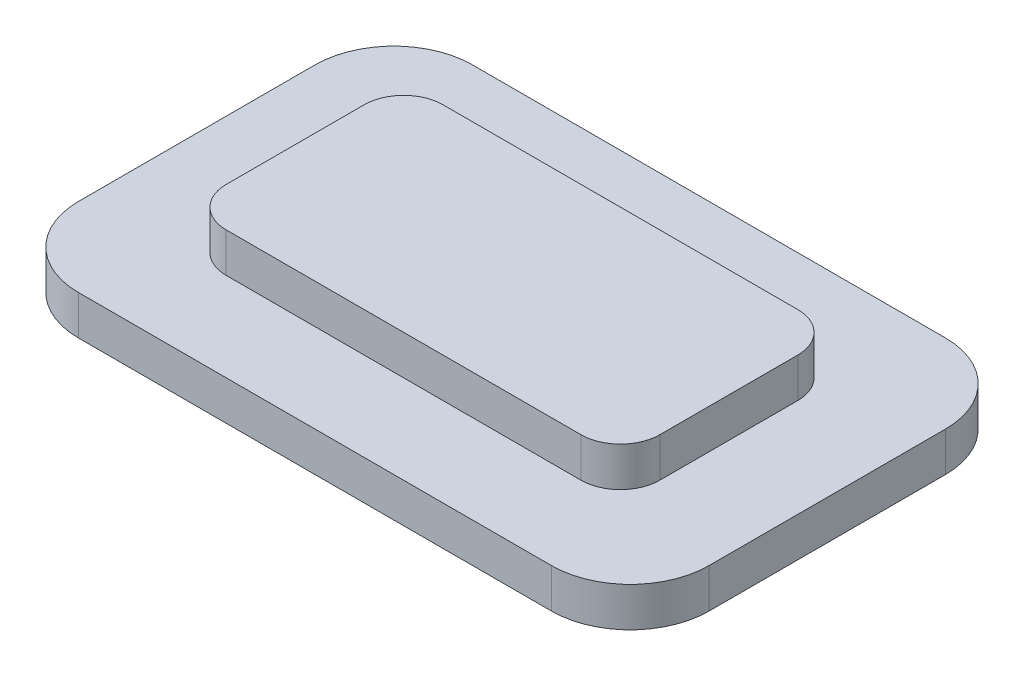
ISO-10303-21;
HEADER;
FILE_DESCRIPTION(('STEP AP214'),'2;1');
FILE_NAME('part.step','',(''),(''),'','','');
FILE_SCHEMA(('AUTOMOTIVE_DESIGN { 1 0 10303 214 1 1 1 1 }'));
ENDSEC;
DATA;
#1=APPLICATION_CONTEXT('core data for automotive mechanical design processes');
#2=APPLICATION_PROTOCOL_DEFINITION('international standard','automotive_design',2000,#1);
#3=PRODUCT_CONTEXT('',#1,'mechanical');
#4=PRODUCT('Part','Part','',(#3));
#5=PRODUCT_RELATED_PRODUCT_CATEGORY('part','',(#4));
#6=PRODUCT_DEFINITION_FORMATION('','',#4);
#7=PRODUCT_DEFINITION_CONTEXT('part definition',#1,'design');
#8=PRODUCT_DEFINITION('design','',#6,#7);
#9=PRODUCT_DEFINITION_SHAPE('','',#8);
#10=(LENGTH_UNIT() NAMED_UNIT(*) SI_UNIT(.MILLI.,.METRE.));
#11=(NAMED_UNIT(*) PLANE_ANGLE_UNIT() SI_UNIT($,.RADIAN.));
#12=(NAMED_UNIT(*) SI_UNIT($,.STERADIAN.) SOLID_ANGLE_UNIT());
#13=UNCERTAINTY_MEASURE_WITH_UNIT(LENGTH_MEASURE(1.E-05),#10,'distance_accuracy_value','');
#14=(GEOMETRIC_REPRESENTATION_CONTEXT(3) GLOBAL_UNCERTAINTY_ASSIGNED_CONTEXT((#13)) GLOBAL_UNIT_ASSIGNED_CONTEXT((#10,
#11,#12)) REPRESENTATION_CONTEXT('',''));
#15=CARTESIAN_POINT('',(0.,0.,0.));
#16=DIRECTION('',(0.,0.,1.));
#17=DIRECTION('',(1.,0.,0.));
#18=AXIS2_PLACEMENT_3D('',#15,#16,#17);
#19=CARTESIAN_POINT('',(5.5,1.,2.75));
#20=DIRECTION('',(0.,0.,1.));
#21=DIRECTION('',(1.,0.,0.));
#22=AXIS2_PLACEMENT_3D('',#19,#20,#21);
#23=PLANE('',#22);
#24=DIRECTION('',(-1.,0.,0.));
#25=VECTOR('',#24,1.);
#26=CARTESIAN_POINT('',(5.5,0.,2.75));
#27=LINE('',#26,#25);
#28=CARTESIAN_POINT('',(4.5,0.,2.75));
#29=VERTEX_POINT('',#28);
#30=CARTESIAN_POINT('',(-4.5,0.,2.75));
#31=VERTEX_POINT('',#30);
#32=EDGE_CURVE('E184',#29,#31,#27,.T.);
#33=ORIENTED_EDGE('',*,*,#32,.F.);
#34=DIRECTION('',(0.,-1.,0.));
#35=VECTOR('',#34,1.);
#36=CARTESIAN_POINT('',(4.5,1.,2.75));
#37=LINE('',#36,#35);
#38=CARTESIAN_POINT('',(4.5,1.,2.75));
#39=VERTEX_POINT('',#38);
#40=EDGE_CURVE('E250',#29,#39,#37,.F.);
#41=ORIENTED_EDGE('',*,*,#40,.T.);
#42=DIRECTION('',(-1.,0.,0.));
#43=VECTOR('',#42,1.);
#44=CARTESIAN_POINT('',(5.5,1.,2.75));
#45=LINE('',#44,#43);
#46=CARTESIAN_POINT('',(-4.5,1.,2.75));
#47=VERTEX_POINT('',#46);
#48=EDGE_CURVE('E194',#39,#47,#45,.T.);
#49=ORIENTED_EDGE('',*,*,#48,.T.);
#50=DIRECTION('',(0.,-1.,0.));
#51=VECTOR('',#50,1.);
#52=CARTESIAN_POINT('',(-4.5,0.,2.75));
#53=LINE('',#52,#51);
#54=EDGE_CURVE('E246',#47,#31,#53,.T.);
#55=ORIENTED_EDGE('',*,*,#54,.T.);
#56=EDGE_LOOP('',(#33,#41,#49,#55));
#57=FACE_BOUND('',#56,.T.);
#58=ADVANCED_FACE('F43',(#57),#23,.T.);
#59=CARTESIAN_POINT('',(5.5,1.,-2.75));
#60=DIRECTION('',(1.,0.,0.));
#61=DIRECTION('',(0.,0.,-1.));
#62=AXIS2_PLACEMENT_3D('',#59,#60,#61);
#63=PLANE('',#62);
#64=DIRECTION('',(0.,0.,1.));
#65=VECTOR('',#64,1.);
#66=CARTESIAN_POINT('',(5.5,0.,-2.75));
#67=LINE('',#66,#65);
#68=CARTESIAN_POINT('',(5.5,0.,-1.75));
#69=VERTEX_POINT('',#68);
#70=CARTESIAN_POINT('',(5.5,0.,1.75));
#71=VERTEX_POINT('',#70);
#72=EDGE_CURVE('E199',#69,#71,#67,.T.);
#73=ORIENTED_EDGE('',*,*,#72,.F.);
#74=DIRECTION('',(0.,-1.,0.));
#75=VECTOR('',#74,1.);
#76=CARTESIAN_POINT('',(5.5,1.,-1.75));
#77=LINE('',#76,#75);
#78=CARTESIAN_POINT('',(5.5,1.,-1.75));
#79=VERTEX_POINT('',#78);
#80=EDGE_CURVE('E231',#69,#79,#77,.F.);
#81=ORIENTED_EDGE('',*,*,#80,.T.);
#82=DIRECTION('',(0.,0.,1.));
#83=VECTOR('',#82,1.);
#84=CARTESIAN_POINT('',(5.5,1.,-2.75));
#85=LINE('',#84,#83);
#86=CARTESIAN_POINT('',(5.5,1.,1.75));
#87=VERTEX_POINT('',#86);
#88=EDGE_CURVE('E207',#79,#87,#85,.T.);
#89=ORIENTED_EDGE('',*,*,#88,.T.);
#90=DIRECTION('',(0.,-1.,0.));
#91=VECTOR('',#90,1.);
#92=CARTESIAN_POINT('',(5.5,1.,1.75));
#93=LINE('',#92,#91);
#94=EDGE_CURVE('E227',#87,#71,#93,.T.);
#95=ORIENTED_EDGE('',*,*,#94,.T.);
#96=EDGE_LOOP('',(#73,#81,#89,#95));
#97=FACE_BOUND('',#96,.T.);
#98=ADVANCED_FACE('F295',(#97),#63,.T.);
#99=CARTESIAN_POINT('',(5.5,1.,-2.75));
#100=DIRECTION('',(0.,0.,1.));
#101=DIRECTION('',(1.,0.,0.));
#102=AXIS2_PLACEMENT_3D('',#99,#100,#101);
#103=PLANE('',#102);
#104=DIRECTION('',(-1.,0.,0.));
#105=VECTOR('',#104,1.);
#106=CARTESIAN_POINT('',(5.5,1.,-2.75));
#107=LINE('',#106,#105);
#108=CARTESIAN_POINT('',(4.5,1.,-2.75));
#109=VERTEX_POINT('',#108);
#110=CARTESIAN_POINT('',(-4.5,1.,-2.75));
#111=VERTEX_POINT('',#110);
#112=EDGE_CURVE('E203',#109,#111,#107,.T.);
#113=ORIENTED_EDGE('',*,*,#112,.F.);
#114=DIRECTION('',(0.,-1.,0.));
#115=VECTOR('',#114,1.);
#116=CARTESIAN_POINT('',(4.5,0.,-2.75));
#117=LINE('',#116,#115);
#118=CARTESIAN_POINT('',(4.5,0.,-2.75));
#119=VERTEX_POINT('',#118);
#120=EDGE_CURVE('E223',#109,#119,#117,.T.);
#121=ORIENTED_EDGE('',*,*,#120,.T.);
#122=DIRECTION('',(-1.,0.,0.));
#123=VECTOR('',#122,1.);
#124=CARTESIAN_POINT('',(5.5,0.,-2.75));
#125=LINE('',#124,#123);
#126=CARTESIAN_POINT('',(-4.5,0.,-2.75));
#127=VERTEX_POINT('',#126);
#128=EDGE_CURVE('E214',#119,#127,#125,.T.);
#129=ORIENTED_EDGE('',*,*,#128,.T.);
#130=DIRECTION('',(0.,-1.,0.));
#131=VECTOR('',#130,1.);
#132=CARTESIAN_POINT('',(-4.5,1.,-2.75));
#133=LINE('',#132,#131);
#134=EDGE_CURVE('E210',#127,#111,#133,.F.);
#135=ORIENTED_EDGE('',*,*,#134,.T.);
#136=EDGE_LOOP('',(#113,#121,#129,#135));
#137=FACE_BOUND('',#136,.T.);
#138=ADVANCED_FACE('F270',(#137),#103,.F.);
#139=CARTESIAN_POINT('',(-5.5,1.,-2.75));
#140=DIRECTION('',(1.,0.,0.));
#141=DIRECTION('',(0.,0.,-1.));
#142=AXIS2_PLACEMENT_3D('',#139,#140,#141);
#143=PLANE('',#142);
#144=DIRECTION('',(0.,0.,1.));
#145=VECTOR('',#144,1.);
#146=CARTESIAN_POINT('',(-5.5,1.,-2.75));
#147=LINE('',#146,#145);
#148=CARTESIAN_POINT('',(-5.5,1.,-1.75));
#149=VERTEX_POINT('',#148);
#150=CARTESIAN_POINT('',(-5.5,1.,1.75));
#151=VERTEX_POINT('',#150);
#152=EDGE_CURVE('E198',#149,#151,#147,.T.);
#153=ORIENTED_EDGE('',*,*,#152,.F.);
#154=DIRECTION('',(0.,-1.,0.));
#155=VECTOR('',#154,1.);
#156=CARTESIAN_POINT('',(-5.5,1.,-1.75));
#157=LINE('',#156,#155);
#158=CARTESIAN_POINT('',(-5.5,0.,-1.75));
#159=VERTEX_POINT('',#158);
#160=EDGE_CURVE('E256',#149,#159,#157,.T.);
#161=ORIENTED_EDGE('',*,*,#160,.T.);
#162=DIRECTION('',(0.,0.,1.));
#163=VECTOR('',#162,1.);
#164=CARTESIAN_POINT('',(-5.5,0.,-2.75));
#165=LINE('',#164,#163);
#166=CARTESIAN_POINT('',(-5.5,0.,1.75));
#167=VERTEX_POINT('',#166);
#168=EDGE_CURVE('E188',#159,#167,#165,.T.);
#169=ORIENTED_EDGE('',*,*,#168,.T.);
#170=DIRECTION('',(0.,-1.,0.));
#171=VECTOR('',#170,1.);
#172=CARTESIAN_POINT('',(-5.5,1.,1.75));
#173=LINE('',#172,#171);
#174=EDGE_CURVE('E253',#167,#151,#173,.F.);
#175=ORIENTED_EDGE('',*,*,#174,.T.);
#176=EDGE_LOOP('',(#153,#161,#169,#175));
#177=FACE_BOUND('',#176,.T.);
#178=ADVANCED_FACE('F280',(#177),#143,.F.);
#179=CARTESIAN_POINT('',(0.,1.,0.));
#180=DIRECTION('',(0.,1.,0.));
#181=DIRECTION('',(0.,0.,1.));
#182=AXIS2_PLACEMENT_3D('',#179,#180,#181);
#183=PLANE('',#182);
#184=ORIENTED_EDGE('',*,*,#88,.F.);
#185=CARTESIAN_POINT('',(4.5,1.,-1.75));
#186=DIRECTION('',(0.,1.,0.));
#187=DIRECTION('',(0.,0.,1.));
#188=AXIS2_PLACEMENT_3D('',#185,#186,#187);
#189=CIRCLE('',#188,1.);
#190=EDGE_CURVE('E243',#79,#109,#189,.T.);
#191=ORIENTED_EDGE('',*,*,#190,.T.);
#192=ORIENTED_EDGE('',*,*,#112,.T.);
#193=CARTESIAN_POINT('',(-4.5,1.,-1.75));
#194=DIRECTION('',(0.,1.,0.));
#195=DIRECTION('',(0.,0.,1.));
#196=AXIS2_PLACEMENT_3D('',#193,#194,#195);
#197=CIRCLE('',#196,1.);
#198=EDGE_CURVE('E237',#111,#149,#197,.T.);
#199=ORIENTED_EDGE('',*,*,#198,.T.);
#200=ORIENTED_EDGE('',*,*,#152,.T.);
#201=CARTESIAN_POINT('',(-4.5,1.,1.75));
#202=DIRECTION('',(0.,1.,0.));
#203=DIRECTION('',(0.,0.,1.));
#204=AXIS2_PLACEMENT_3D('',#201,#202,#203);
#205=CIRCLE('',#204,1.);
#206=EDGE_CURVE('E234',#151,#47,#205,.T.);
#207=ORIENTED_EDGE('',*,*,#206,.T.);
#208=ORIENTED_EDGE('',*,*,#48,.F.);
#209=CARTESIAN_POINT('',(4.5,1.,1.75));
#210=DIRECTION('',(0.,1.,0.));
#211=DIRECTION('',(0.,0.,1.));
#212=AXIS2_PLACEMENT_3D('',#209,#210,#211);
#213=CIRCLE('',#212,1.);
#214=EDGE_CURVE('E240',#39,#87,#213,.T.);
#215=ORIENTED_EDGE('',*,*,#214,.T.);
#216=EDGE_LOOP('',(#184,#191,#192,#199,#200,#207,#208,#215));
#217=FACE_BOUND('',#216,.T.);
#218=ADVANCED_FACE('F277',(#217),#183,.T.);
#219=CARTESIAN_POINT('',(6.,-1.,3.));
#220=DIRECTION('',(0.,1.,0.));
#221=DIRECTION('',(0.,0.,1.));
#222=AXIS2_PLACEMENT_3D('',#219,#220,#221);
#223=CYLINDRICAL_SURFACE('',#222,2.);
#224=CARTESIAN_POINT('',(6.,0.,3.));
#225=DIRECTION('',(0.,-1.,0.));
#226=DIRECTION('',(0.,0.,1.));
#227=AXIS2_PLACEMENT_3D('',#224,#225,#226);
#228=CIRCLE('',#227,2.);
#229=CARTESIAN_POINT('',(8.,0.,3.));
#230=VERTEX_POINT('',#229);
#231=CARTESIAN_POINT('',(6.,0.,5.));
#232=VERTEX_POINT('',#231);
#233=EDGE_CURVE('E182',#230,#232,#228,.T.);
#234=ORIENTED_EDGE('',*,*,#233,.T.);
#235=DIRECTION('',(0.,1.,0.));
#236=VECTOR('',#235,1.);
#237=CARTESIAN_POINT('',(6.,-1.,5.));
#238=LINE('',#237,#236);
#239=CARTESIAN_POINT('',(6.,-1.,5.));
#240=VERTEX_POINT('',#239);
#241=EDGE_CURVE('E160',#240,#232,#238,.T.);
#242=ORIENTED_EDGE('',*,*,#241,.F.);
#243=CARTESIAN_POINT('',(6.,-1.,3.));
#244=DIRECTION('',(0.,-1.,0.));
#245=DIRECTION('',(0.,0.,1.));
#246=AXIS2_PLACEMENT_3D('',#243,#244,#245);
#247=CIRCLE('',#246,2.);
#248=CARTESIAN_POINT('',(8.,-1.,3.));
#249=VERTEX_POINT('',#248);
#250=EDGE_CURVE('E168',#249,#240,#247,.T.);
#251=ORIENTED_EDGE('',*,*,#250,.F.);
#252=DIRECTION('',(0.,1.,0.));
#253=VECTOR('',#252,1.);
#254=CARTESIAN_POINT('',(8.,-1.,3.));
#255=LINE('',#254,#253);
#256=EDGE_CURVE('E501',#249,#230,#255,.T.);
#257=ORIENTED_EDGE('',*,*,#256,.T.);
#258=EDGE_LOOP('',(#234,#242,#251,#257));
#259=FACE_BOUND('',#258,.T.);
#260=ADVANCED_FACE('F180',(#259),#223,.T.);
#261=CARTESIAN_POINT('',(6.,-1.,5.));
#262=DIRECTION('',(0.,0.,-1.));
#263=DIRECTION('',(-1.,0.,0.));
#264=AXIS2_PLACEMENT_3D('',#261,#262,#263);
#265=PLANE('',#264);
#266=DIRECTION('',(-1.,0.,0.));
#267=VECTOR('',#266,1.);
#268=CARTESIAN_POINT('',(6.,0.,5.));
#269=LINE('',#268,#267);
#270=CARTESIAN_POINT('',(-6.,0.,5.));
#271=VERTEX_POINT('',#270);
#272=EDGE_CURVE('E511',#232,#271,#269,.T.);
#273=ORIENTED_EDGE('',*,*,#272,.T.);
#274=DIRECTION('',(0.,1.,0.));
#275=VECTOR('',#274,1.);
#276=CARTESIAN_POINT('',(-6.,-1.,5.));
#277=LINE('',#276,#275);
#278=CARTESIAN_POINT('',(-6.,-1.,5.));
#279=VERTEX_POINT('',#278);
#280=EDGE_CURVE('E163',#279,#271,#277,.T.);
#281=ORIENTED_EDGE('',*,*,#280,.F.);
#282=DIRECTION('',(-1.,0.,0.));
#283=VECTOR('',#282,1.);
#284=CARTESIAN_POINT('',(6.,-1.,5.));
#285=LINE('',#284,#283);
#286=EDGE_CURVE('E156',#240,#279,#285,.T.);
#287=ORIENTED_EDGE('',*,*,#286,.F.);
#288=ORIENTED_EDGE('',*,*,#241,.T.);
#289=EDGE_LOOP('',(#273,#281,#287,#288));
#290=FACE_BOUND('',#289,.T.);
#291=ADVANCED_FACE('F158',(#290),#265,.F.);
#292=CARTESIAN_POINT('',(-6.,-1.,3.));
#293=DIRECTION('',(0.,1.,0.));
#294=DIRECTION('',(0.,0.,1.));
#295=AXIS2_PLACEMENT_3D('',#292,#293,#294);
#296=CYLINDRICAL_SURFACE('',#295,2.);
#297=CARTESIAN_POINT('',(-6.,0.,3.));
#298=DIRECTION('',(0.,-1.,0.));
#299=DIRECTION('',(0.,0.,-1.));
#300=AXIS2_PLACEMENT_3D('',#297,#298,#299);
#301=CIRCLE('',#300,2.);
#302=CARTESIAN_POINT('',(-8.,0.,3.));
#303=VERTEX_POINT('',#302);
#304=EDGE_CURVE('E515',#271,#303,#301,.T.);
#305=ORIENTED_EDGE('',*,*,#304,.T.);
#306=DIRECTION('',(0.,1.,0.));
#307=VECTOR('',#306,1.);
#308=CARTESIAN_POINT('',(-8.,-1.,3.));
#309=LINE('',#308,#307);
#310=CARTESIAN_POINT('',(-8.,-1.,3.));
#311=VERTEX_POINT('',#310);
#312=EDGE_CURVE('E190',#311,#303,#309,.T.);
#313=ORIENTED_EDGE('',*,*,#312,.F.);
#314=CARTESIAN_POINT('',(-6.,-1.,3.));
#315=DIRECTION('',(0.,-1.,0.));
#316=DIRECTION('',(0.,0.,-1.));
#317=AXIS2_PLACEMENT_3D('',#314,#315,#316);
#318=CIRCLE('',#317,2.);
#319=EDGE_CURVE('E167',#279,#311,#318,.T.);
#320=ORIENTED_EDGE('',*,*,#319,.F.);
#321=ORIENTED_EDGE('',*,*,#280,.T.);
#322=EDGE_LOOP('',(#305,#313,#320,#321));
#323=FACE_BOUND('',#322,.T.);
#324=ADVANCED_FACE('F324',(#323),#296,.T.);
#325=CARTESIAN_POINT('',(-8.,-1.,3.));
#326=DIRECTION('',(1.,0.,0.));
#327=DIRECTION('',(0.,0.,-1.));
#328=AXIS2_PLACEMENT_3D('',#325,#326,#327);
#329=PLANE('',#328);
#330=DIRECTION('',(0.,0.,-1.));
#331=VECTOR('',#330,1.);
#332=CARTESIAN_POINT('',(-8.,0.,3.));
#333=LINE('',#332,#331);
#334=CARTESIAN_POINT('',(-8.,0.,-3.));
#335=VERTEX_POINT('',#334);
#336=EDGE_CURVE('E522',#303,#335,#333,.T.);
#337=ORIENTED_EDGE('',*,*,#336,.T.);
#338=DIRECTION('',(0.,1.,0.));
#339=VECTOR('',#338,1.);
#340=CARTESIAN_POINT('',(-8.,-1.,-3.));
#341=LINE('',#340,#339);
#342=CARTESIAN_POINT('',(-8.,-1.,-3.));
#343=VERTEX_POINT('',#342);
#344=EDGE_CURVE('E543',#343,#335,#341,.T.);
#345=ORIENTED_EDGE('',*,*,#344,.F.);
#346=DIRECTION('',(0.,0.,-1.));
#347=VECTOR('',#346,1.);
#348=CARTESIAN_POINT('',(-8.,-1.,3.));
#349=LINE('',#348,#347);
#350=EDGE_CURVE('E552',#311,#343,#349,.T.);
#351=ORIENTED_EDGE('',*,*,#350,.F.);
#352=ORIENTED_EDGE('',*,*,#312,.T.);
#353=EDGE_LOOP('',(#337,#345,#351,#352));
#354=FACE_BOUND('',#353,.T.);
#355=ADVANCED_FACE('F327',(#354),#329,.F.);
#356=CARTESIAN_POINT('',(-6.,-1.,-3.));
#357=DIRECTION('',(0.,1.,0.));
#358=DIRECTION('',(0.,0.,1.));
#359=AXIS2_PLACEMENT_3D('',#356,#357,#358);
#360=CYLINDRICAL_SURFACE('',#359,2.);
#361=CARTESIAN_POINT('',(-6.,0.,-3.));
#362=DIRECTION('',(0.,-1.,0.));
#363=DIRECTION('',(0.,0.,1.));
#364=AXIS2_PLACEMENT_3D('',#361,#362,#363);
#365=CIRCLE('',#364,2.);
#366=CARTESIAN_POINT('',(-6.,0.,-5.));
#367=VERTEX_POINT('',#366);
#368=EDGE_CURVE('E525',#335,#367,#365,.T.);
#369=ORIENTED_EDGE('',*,*,#368,.T.);
#370=DIRECTION('',(0.,1.,0.));
#371=VECTOR('',#370,1.);
#372=CARTESIAN_POINT('',(-6.,-1.,-5.));
#373=LINE('',#372,#371);
#374=CARTESIAN_POINT('',(-6.,-1.,-5.));
#375=VERTEX_POINT('',#374);
#376=EDGE_CURVE('E539',#375,#367,#373,.T.);
#377=ORIENTED_EDGE('',*,*,#376,.F.);
#378=CARTESIAN_POINT('',(-6.,-1.,-3.));
#379=DIRECTION('',(0.,-1.,0.));
#380=DIRECTION('',(0.,0.,1.));
#381=AXIS2_PLACEMENT_3D('',#378,#379,#380);
#382=CIRCLE('',#381,2.);
#383=EDGE_CURVE('E563',#343,#375,#382,.T.);
#384=ORIENTED_EDGE('',*,*,#383,.F.);
#385=ORIENTED_EDGE('',*,*,#344,.T.);
#386=EDGE_LOOP('',(#369,#377,#384,#385));
#387=FACE_BOUND('',#386,.T.);
#388=ADVANCED_FACE('F331',(#387),#360,.T.);
#389=CARTESIAN_POINT('',(6.,-1.,-5.));
#390=DIRECTION('',(0.,0.,1.));
#391=DIRECTION('',(1.,0.,0.));
#392=AXIS2_PLACEMENT_3D('',#389,#390,#391);
#393=PLANE('',#392);
#394=DIRECTION('',(1.,0.,0.));
#395=VECTOR('',#394,1.);
#396=CARTESIAN_POINT('',(6.,0.,-5.));
#397=LINE('',#396,#395);
#398=CARTESIAN_POINT('',(6.,0.,-5.));
#399=VERTEX_POINT('',#398);
#400=EDGE_CURVE('E528',#367,#399,#397,.T.);
#401=ORIENTED_EDGE('',*,*,#400,.T.);
#402=DIRECTION('',(0.,1.,0.));
#403=VECTOR('',#402,1.);
#404=CARTESIAN_POINT('',(6.,-1.,-5.));
#405=LINE('',#404,#403);
#406=CARTESIAN_POINT('',(6.,-1.,-5.));
#407=VERTEX_POINT('',#406);
#408=EDGE_CURVE('E535',#407,#399,#405,.T.);
#409=ORIENTED_EDGE('',*,*,#408,.F.);
#410=DIRECTION('',(1.,0.,0.));
#411=VECTOR('',#410,1.);
#412=CARTESIAN_POINT('',(6.,-1.,-5.));
#413=LINE('',#412,#411);
#414=EDGE_CURVE('E559',#375,#407,#413,.T.);
#415=ORIENTED_EDGE('',*,*,#414,.F.);
#416=ORIENTED_EDGE('',*,*,#376,.T.);
#417=EDGE_LOOP('',(#401,#409,#415,#416));
#418=FACE_BOUND('',#417,.T.);
#419=ADVANCED_FACE('F335',(#418),#393,.F.);
#420=CARTESIAN_POINT('',(6.,-1.,-3.));
#421=DIRECTION('',(0.,1.,0.));
#422=DIRECTION('',(0.,0.,1.));
#423=AXIS2_PLACEMENT_3D('',#420,#421,#422);
#424=CYLINDRICAL_SURFACE('',#423,2.);
#425=CARTESIAN_POINT('',(6.,0.,-3.));
#426=DIRECTION('',(0.,-1.,0.));
#427=DIRECTION('',(0.,0.,1.));
#428=AXIS2_PLACEMENT_3D('',#425,#426,#427);
#429=CIRCLE('',#428,2.);
#430=CARTESIAN_POINT('',(8.,0.,-3.));
#431=VERTEX_POINT('',#430);
#432=EDGE_CURVE('E506',#399,#431,#429,.T.);
#433=ORIENTED_EDGE('',*,*,#432,.T.);
#434=DIRECTION('',(0.,1.,0.));
#435=VECTOR('',#434,1.);
#436=CARTESIAN_POINT('',(8.,-1.,-3.));
#437=LINE('',#436,#435);
#438=CARTESIAN_POINT('',(8.,-1.,-3.));
#439=VERTEX_POINT('',#438);
#440=EDGE_CURVE('E503',#439,#431,#437,.T.);
#441=ORIENTED_EDGE('',*,*,#440,.F.);
#442=CARTESIAN_POINT('',(6.,-1.,-3.));
#443=DIRECTION('',(0.,-1.,0.));
#444=DIRECTION('',(0.,0.,1.));
#445=AXIS2_PLACEMENT_3D('',#442,#443,#444);
#446=CIRCLE('',#445,2.);
#447=EDGE_CURVE('E562',#407,#439,#446,.T.);
#448=ORIENTED_EDGE('',*,*,#447,.F.);
#449=ORIENTED_EDGE('',*,*,#408,.T.);
#450=EDGE_LOOP('',(#433,#441,#448,#449));
#451=FACE_BOUND('',#450,.T.);
#452=ADVANCED_FACE('F339',(#451),#424,.T.);
#453=CARTESIAN_POINT('',(8.,-1.,3.));
#454=DIRECTION('',(-1.,0.,0.));
#455=DIRECTION('',(0.,0.,1.));
#456=AXIS2_PLACEMENT_3D('',#453,#454,#455);
#457=PLANE('',#456);
#458=DIRECTION('',(0.,0.,1.));
#459=VECTOR('',#458,1.);
#460=CARTESIAN_POINT('',(8.,0.,3.));
#461=LINE('',#460,#459);
#462=EDGE_CURVE('E178',#431,#230,#461,.T.);
#463=ORIENTED_EDGE('',*,*,#462,.T.);
#464=ORIENTED_EDGE('',*,*,#256,.F.);
#465=DIRECTION('',(0.,0.,1.));
#466=VECTOR('',#465,1.);
#467=CARTESIAN_POINT('',(8.,-1.,3.));
#468=LINE('',#467,#466);
#469=EDGE_CURVE('E173',#439,#249,#468,.T.);
#470=ORIENTED_EDGE('',*,*,#469,.F.);
#471=ORIENTED_EDGE('',*,*,#440,.T.);
#472=EDGE_LOOP('',(#463,#464,#470,#471));
#473=FACE_BOUND('',#472,.T.);
#474=ADVANCED_FACE('F343',(#473),#457,.F.);
#475=CARTESIAN_POINT('',(6.,-1.,3.));
#476=DIRECTION('',(0.,1.,0.));
#477=DIRECTION('',(0.,0.,1.));
#478=AXIS2_PLACEMENT_3D('',#475,#476,#477);
#479=PLANE('',#478);
#480=ORIENTED_EDGE('',*,*,#250,.T.);
#481=ORIENTED_EDGE('',*,*,#286,.T.);
#482=ORIENTED_EDGE('',*,*,#319,.T.);
#483=ORIENTED_EDGE('',*,*,#350,.T.);
#484=ORIENTED_EDGE('',*,*,#383,.T.);
#485=ORIENTED_EDGE('',*,*,#414,.T.);
#486=ORIENTED_EDGE('',*,*,#447,.T.);
#487=ORIENTED_EDGE('',*,*,#469,.T.);
#488=EDGE_LOOP('',(#480,#481,#482,#483,#484,#485,#486,#487));
#489=FACE_BOUND('',#488,.T.);
#490=ADVANCED_FACE('F171',(#489),#479,.F.);
#491=CARTESIAN_POINT('',(6.,0.,3.));
#492=DIRECTION('',(0.,1.,0.));
#493=DIRECTION('',(0.,0.,1.));
#494=AXIS2_PLACEMENT_3D('',#491,#492,#493);
#495=PLANE('',#494);
#496=ORIENTED_EDGE('',*,*,#128,.F.);
#497=CARTESIAN_POINT('',(4.5,0.,-1.75));
#498=DIRECTION('',(0.,1.,0.));
#499=DIRECTION('',(0.,0.,1.));
#500=AXIS2_PLACEMENT_3D('',#497,#498,#499);
#501=CIRCLE('',#500,1.);
#502=EDGE_CURVE('E259',#119,#69,#501,.F.);
#503=ORIENTED_EDGE('',*,*,#502,.T.);
#504=ORIENTED_EDGE('',*,*,#72,.T.);
#505=CARTESIAN_POINT('',(4.5,0.,1.75));
#506=DIRECTION('',(0.,1.,0.));
#507=DIRECTION('',(0.,0.,1.));
#508=AXIS2_PLACEMENT_3D('',#505,#506,#507);
#509=CIRCLE('',#508,1.);
#510=EDGE_CURVE('E262',#71,#29,#509,.F.);
#511=ORIENTED_EDGE('',*,*,#510,.T.);
#512=ORIENTED_EDGE('',*,*,#32,.T.);
#513=CARTESIAN_POINT('',(-4.5,0.,1.75));
#514=DIRECTION('',(0.,1.,0.));
#515=DIRECTION('',(0.,0.,1.));
#516=AXIS2_PLACEMENT_3D('',#513,#514,#515);
#517=CIRCLE('',#516,1.);
#518=EDGE_CURVE('E11',#31,#167,#517,.F.);
#519=ORIENTED_EDGE('',*,*,#518,.T.);
#520=ORIENTED_EDGE('',*,*,#168,.F.);
#521=CARTESIAN_POINT('',(-4.5,0.,-1.75));
#522=DIRECTION('',(0.,1.,0.));
#523=DIRECTION('',(0.,0.,1.));
#524=AXIS2_PLACEMENT_3D('',#521,#522,#523);
#525=CIRCLE('',#524,1.);
#526=EDGE_CURVE('E52',#159,#127,#525,.F.);
#527=ORIENTED_EDGE('',*,*,#526,.T.);
#528=EDGE_LOOP('',(#496,#503,#504,#511,#512,#519,#520,#527));
#529=FACE_BOUND('',#528,.T.);
#530=ORIENTED_EDGE('',*,*,#233,.F.);
#531=ORIENTED_EDGE('',*,*,#462,.F.);
#532=ORIENTED_EDGE('',*,*,#432,.F.);
#533=ORIENTED_EDGE('',*,*,#400,.F.);
#534=ORIENTED_EDGE('',*,*,#368,.F.);
#535=ORIENTED_EDGE('',*,*,#336,.F.);
#536=ORIENTED_EDGE('',*,*,#304,.F.);
#537=ORIENTED_EDGE('',*,*,#272,.F.);
#538=EDGE_LOOP('',(#530,#531,#532,#533,#534,#535,#536,#537));
#539=FACE_BOUND('',#538,.T.);
#540=ADVANCED_FACE('F266',(#529,#539),#495,.T.);
#541=CARTESIAN_POINT('',(4.5,1.,-1.75));
#542=DIRECTION('',(0.,1.,0.));
#543=DIRECTION('',(0.,0.,1.));
#544=AXIS2_PLACEMENT_3D('',#541,#542,#543);
#545=CYLINDRICAL_SURFACE('',#544,1.);
#546=ORIENTED_EDGE('',*,*,#190,.F.);
#547=ORIENTED_EDGE('',*,*,#80,.F.);
#548=ORIENTED_EDGE('',*,*,#502,.F.);
#549=ORIENTED_EDGE('',*,*,#120,.F.);
#550=EDGE_LOOP('',(#546,#547,#548,#549));
#551=FACE_BOUND('',#550,.T.);
#552=ADVANCED_FACE('F298',(#551),#545,.T.);
#553=CARTESIAN_POINT('',(4.5,1.,1.75));
#554=DIRECTION('',(0.,-1.,0.));
#555=DIRECTION('',(0.,0.,-1.));
#556=AXIS2_PLACEMENT_3D('',#553,#554,#555);
#557=CYLINDRICAL_SURFACE('',#556,1.);
#558=ORIENTED_EDGE('',*,*,#214,.F.);
#559=ORIENTED_EDGE('',*,*,#40,.F.);
#560=ORIENTED_EDGE('',*,*,#510,.F.);
#561=ORIENTED_EDGE('',*,*,#94,.F.);
#562=EDGE_LOOP('',(#558,#559,#560,#561));
#563=FACE_BOUND('',#562,.T.);
#564=ADVANCED_FACE('F290',(#563),#557,.T.);
#565=CARTESIAN_POINT('',(-4.5,1.,-1.75));
#566=DIRECTION('',(0.,-1.,0.));
#567=DIRECTION('',(0.,0.,-1.));
#568=AXIS2_PLACEMENT_3D('',#565,#566,#567);
#569=CYLINDRICAL_SURFACE('',#568,1.);
#570=ORIENTED_EDGE('',*,*,#198,.F.);
#571=ORIENTED_EDGE('',*,*,#134,.F.);
#572=ORIENTED_EDGE('',*,*,#526,.F.);
#573=ORIENTED_EDGE('',*,*,#160,.F.);
#574=EDGE_LOOP('',(#570,#571,#572,#573));
#575=FACE_BOUND('',#574,.T.);
#576=ADVANCED_FACE('F273',(#575),#569,.T.);
#577=CARTESIAN_POINT('',(-4.5,1.,1.75));
#578=DIRECTION('',(0.,1.,0.));
#579=DIRECTION('',(0.,0.,1.));
#580=AXIS2_PLACEMENT_3D('',#577,#578,#579);
#581=CYLINDRICAL_SURFACE('',#580,1.);
#582=ORIENTED_EDGE('',*,*,#206,.F.);
#583=ORIENTED_EDGE('',*,*,#174,.F.);
#584=ORIENTED_EDGE('',*,*,#518,.F.);
#585=ORIENTED_EDGE('',*,*,#54,.F.);
#586=EDGE_LOOP('',(#582,#583,#584,#585));
#587=FACE_BOUND('',#586,.T.);
#588=ADVANCED_FACE('F45',(#587),#581,.T.);
#589=CLOSED_SHELL('',(#58,#98,#138,#178,#218,#260,#291,#324,#355,#388,#419,#452,#474,#490,#540,
#552,#564,#576,#588));
#590=MANIFOLD_SOLID_BREP('B2',#589);
#591=ADVANCED_BREP_SHAPE_REPRESENTATION('',(#18,#590),#14);
#592=SHAPE_DEFINITION_REPRESENTATION(#9,#591);
ENDSEC;
END-ISO-10303-21;
